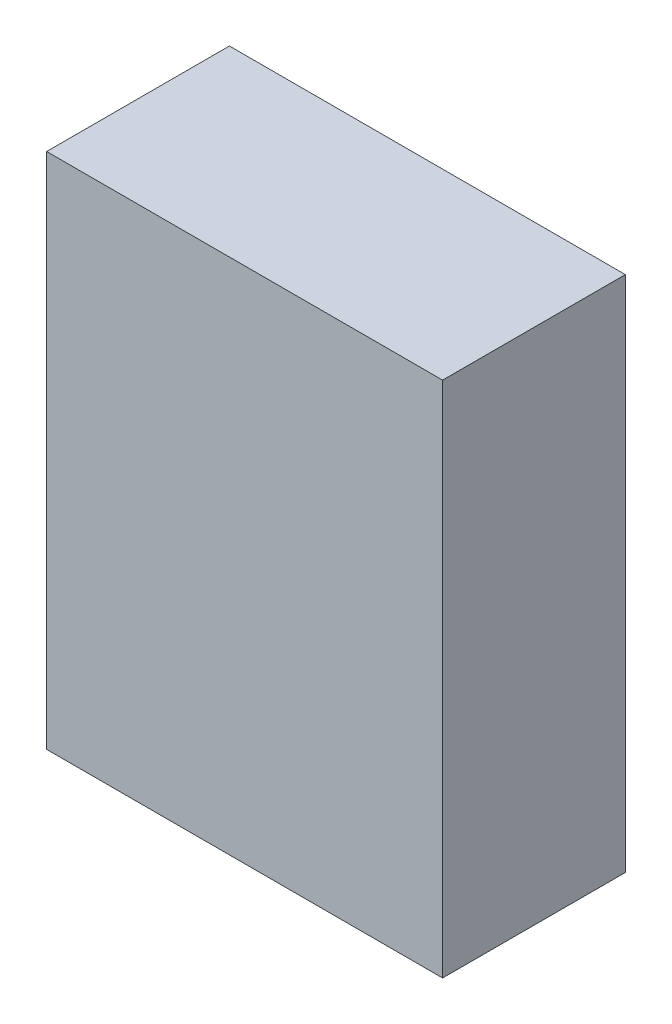
ISO-10303-21;
HEADER;
FILE_DESCRIPTION(('STEP AP214'),'2;1');
FILE_NAME('part.step','',(''),(''),'','','');
FILE_SCHEMA(('AUTOMOTIVE_DESIGN { 1 0 10303 214 1 1 1 1 }'));
ENDSEC;
DATA;
#1=APPLICATION_CONTEXT('core data for automotive mechanical design processes');
#2=APPLICATION_PROTOCOL_DEFINITION('international standard','automotive_design',2000,#1);
#3=PRODUCT_CONTEXT('',#1,'mechanical');
#4=PRODUCT('Part','Part','',(#3));
#5=PRODUCT_RELATED_PRODUCT_CATEGORY('part','',(#4));
#6=PRODUCT_DEFINITION_FORMATION('','',#4);
#7=PRODUCT_DEFINITION_CONTEXT('part definition',#1,'design');
#8=PRODUCT_DEFINITION('design','',#6,#7);
#9=PRODUCT_DEFINITION_SHAPE('','',#8);
#10=(LENGTH_UNIT() NAMED_UNIT(*) SI_UNIT(.MILLI.,.METRE.));
#11=(NAMED_UNIT(*) PLANE_ANGLE_UNIT() SI_UNIT($,.RADIAN.));
#12=(NAMED_UNIT(*) SI_UNIT($,.STERADIAN.) SOLID_ANGLE_UNIT());
#13=UNCERTAINTY_MEASURE_WITH_UNIT(LENGTH_MEASURE(1.E-05),#10,'distance_accuracy_value','');
#14=(GEOMETRIC_REPRESENTATION_CONTEXT(3) GLOBAL_UNCERTAINTY_ASSIGNED_CONTEXT((#13)) GLOBAL_UNIT_ASSIGNED_CONTEXT((#10,
#11,#12)) REPRESENTATION_CONTEXT('',''));
#15=CARTESIAN_POINT('',(0.,0.,0.));
#16=DIRECTION('',(0.,0.,1.));
#17=DIRECTION('',(1.,0.,0.));
#18=AXIS2_PLACEMENT_3D('',#15,#16,#17);
#19=CARTESIAN_POINT('',(-0.6499987,0.85000084,0.5999988));
#20=DIRECTION('',(0.,0.,-1.));
#21=DIRECTION('',(-1.,0.,0.));
#22=AXIS2_PLACEMENT_3D('',#19,#20,#21);
#23=PLANE('',#22);
#24=DIRECTION('',(1.,0.,0.));
#25=VECTOR('',#24,1.);
#26=CARTESIAN_POINT('',(-0.6499987,-0.8499983,0.5999988));
#27=LINE('',#26,#25);
#28=CARTESIAN_POINT('',(-0.6499987,-0.8499983,0.5999988));
#29=VERTEX_POINT('',#28);
#30=CARTESIAN_POINT('',(0.65000124,-0.8499983,0.5999988));
#31=VERTEX_POINT('',#30);
#32=EDGE_CURVE('E55',#29,#31,#27,.T.);
#33=ORIENTED_EDGE('',*,*,#32,.T.);
#34=DIRECTION('',(0.,1.,0.));
#35=VECTOR('',#34,1.);
#36=CARTESIAN_POINT('',(0.65000124,-0.8499983,0.5999988));
#37=LINE('',#36,#35);
#38=CARTESIAN_POINT('',(0.65000124,0.85000084,0.5999988));
#39=VERTEX_POINT('',#38);
#40=EDGE_CURVE('E57',#31,#39,#37,.T.);
#41=ORIENTED_EDGE('',*,*,#40,.T.);
#42=DIRECTION('',(1.,0.,0.));
#43=VECTOR('',#42,1.);
#44=CARTESIAN_POINT('',(0.65000124,0.85000084,0.5999988));
#45=LINE('',#44,#43);
#46=CARTESIAN_POINT('',(-0.6499987,0.85000084,0.5999988));
#47=VERTEX_POINT('',#46);
#48=EDGE_CURVE('E20',#39,#47,#45,.F.);
#49=ORIENTED_EDGE('',*,*,#48,.T.);
#50=DIRECTION('',(0.,1.,0.));
#51=VECTOR('',#50,1.);
#52=CARTESIAN_POINT('',(-0.6499987,0.85000084,0.5999988));
#53=LINE('',#52,#51);
#54=EDGE_CURVE('E80',#47,#29,#53,.F.);
#55=ORIENTED_EDGE('',*,*,#54,.T.);
#56=EDGE_LOOP('',(#33,#41,#49,#55));
#57=FACE_BOUND('',#56,.T.);
#58=ADVANCED_FACE('F17',(#57),#23,.F.);
#59=CARTESIAN_POINT('',(0.65000124,0.85000084,0.));
#60=DIRECTION('',(0.,-1.,0.));
#61=DIRECTION('',(0.,0.,-1.));
#62=AXIS2_PLACEMENT_3D('',#59,#60,#61);
#63=PLANE('',#62);
#64=DIRECTION('',(0.,0.,-1.));
#65=VECTOR('',#64,1.);
#66=CARTESIAN_POINT('',(-0.6499987,0.85000084,0.));
#67=LINE('',#66,#65);
#68=CARTESIAN_POINT('',(-0.6499987,0.85000084,0.));
#69=VERTEX_POINT('',#68);
#70=EDGE_CURVE('E68',#69,#47,#67,.F.);
#71=ORIENTED_EDGE('',*,*,#70,.T.);
#72=ORIENTED_EDGE('',*,*,#48,.F.);
#73=DIRECTION('',(0.,0.,1.));
#74=VECTOR('',#73,1.);
#75=CARTESIAN_POINT('',(0.65000124,0.85000084,0.));
#76=LINE('',#75,#74);
#77=CARTESIAN_POINT('',(0.65000124,0.85000084,0.));
#78=VERTEX_POINT('',#77);
#79=EDGE_CURVE('E63',#39,#78,#76,.F.);
#80=ORIENTED_EDGE('',*,*,#79,.T.);
#81=DIRECTION('',(-1.,0.,0.));
#82=VECTOR('',#81,1.);
#83=CARTESIAN_POINT('',(-0.6499987,0.85000084,0.));
#84=LINE('',#83,#82);
#85=EDGE_CURVE('E83',#69,#78,#84,.F.);
#86=ORIENTED_EDGE('',*,*,#85,.F.);
#87=EDGE_LOOP('',(#71,#72,#80,#86));
#88=FACE_BOUND('',#87,.T.);
#89=ADVANCED_FACE('F65',(#88),#63,.F.);
#90=CARTESIAN_POINT('',(0.65000124,-0.8499983,0.));
#91=DIRECTION('',(-1.,0.,0.));
#92=DIRECTION('',(0.,0.,1.));
#93=AXIS2_PLACEMENT_3D('',#90,#91,#92);
#94=PLANE('',#93);
#95=ORIENTED_EDGE('',*,*,#79,.F.);
#96=ORIENTED_EDGE('',*,*,#40,.F.);
#97=DIRECTION('',(0.,0.,1.));
#98=VECTOR('',#97,1.);
#99=CARTESIAN_POINT('',(0.65000124,-0.8499983,0.));
#100=LINE('',#99,#98);
#101=CARTESIAN_POINT('',(0.65000124,-0.8499983,0.));
#102=VERTEX_POINT('',#101);
#103=EDGE_CURVE('E75',#31,#102,#100,.F.);
#104=ORIENTED_EDGE('',*,*,#103,.T.);
#105=DIRECTION('',(0.,1.,0.));
#106=VECTOR('',#105,1.);
#107=CARTESIAN_POINT('',(0.65000124,0.85000084,0.));
#108=LINE('',#107,#106);
#109=EDGE_CURVE('E72',#78,#102,#108,.F.);
#110=ORIENTED_EDGE('',*,*,#109,.F.);
#111=EDGE_LOOP('',(#95,#96,#104,#110));
#112=FACE_BOUND('',#111,.T.);
#113=ADVANCED_FACE('F70',(#112),#94,.F.);
#114=CARTESIAN_POINT('',(-0.6499987,-0.8499983,0.));
#115=DIRECTION('',(0.,1.,0.));
#116=DIRECTION('',(0.,0.,1.));
#117=AXIS2_PLACEMENT_3D('',#114,#115,#116);
#118=PLANE('',#117);
#119=ORIENTED_EDGE('',*,*,#103,.F.);
#120=ORIENTED_EDGE('',*,*,#32,.F.);
#121=DIRECTION('',(0.,0.,-1.));
#122=VECTOR('',#121,1.);
#123=CARTESIAN_POINT('',(-0.6499987,-0.8499983,0.));
#124=LINE('',#123,#122);
#125=CARTESIAN_POINT('',(-0.6499987,-0.8499983,0.));
#126=VERTEX_POINT('',#125);
#127=EDGE_CURVE('E35',#29,#126,#124,.T.);
#128=ORIENTED_EDGE('',*,*,#127,.T.);
#129=DIRECTION('',(-1.,0.,0.));
#130=VECTOR('',#129,1.);
#131=CARTESIAN_POINT('',(-0.6499987,-0.8499983,0.));
#132=LINE('',#131,#130);
#133=EDGE_CURVE('E26',#102,#126,#132,.T.);
#134=ORIENTED_EDGE('',*,*,#133,.F.);
#135=EDGE_LOOP('',(#119,#120,#128,#134));
#136=FACE_BOUND('',#135,.T.);
#137=ADVANCED_FACE('F89',(#136),#118,.F.);
#138=CARTESIAN_POINT('',(-0.6499987,0.85000084,0.));
#139=DIRECTION('',(1.,0.,0.));
#140=DIRECTION('',(0.,0.,-1.));
#141=AXIS2_PLACEMENT_3D('',#138,#139,#140);
#142=PLANE('',#141);
#143=ORIENTED_EDGE('',*,*,#127,.F.);
#144=ORIENTED_EDGE('',*,*,#54,.F.);
#145=ORIENTED_EDGE('',*,*,#70,.F.);
#146=DIRECTION('',(0.,1.,0.));
#147=VECTOR('',#146,1.);
#148=CARTESIAN_POINT('',(-0.6499987,0.85000084,0.));
#149=LINE('',#148,#147);
#150=EDGE_CURVE('E11',#126,#69,#149,.T.);
#151=ORIENTED_EDGE('',*,*,#150,.F.);
#152=EDGE_LOOP('',(#143,#144,#145,#151));
#153=FACE_BOUND('',#152,.T.);
#154=ADVANCED_FACE('F91',(#153),#142,.F.);
#155=CARTESIAN_POINT('',(-0.6499987,0.85000084,0.));
#156=DIRECTION('',(0.,0.,-1.));
#157=DIRECTION('',(-1.,0.,0.));
#158=AXIS2_PLACEMENT_3D('',#155,#156,#157);
#159=PLANE('',#158);
#160=ORIENTED_EDGE('',*,*,#133,.T.);
#161=ORIENTED_EDGE('',*,*,#150,.T.);
#162=ORIENTED_EDGE('',*,*,#85,.T.);
#163=ORIENTED_EDGE('',*,*,#109,.T.);
#164=EDGE_LOOP('',(#160,#161,#162,#163));
#165=FACE_BOUND('',#164,.T.);
#166=ADVANCED_FACE('F88',(#165),#159,.T.);
#167=CLOSED_SHELL('',(#58,#89,#113,#137,#154,#166));
#168=MANIFOLD_SOLID_BREP('B1',#167);
#169=ADVANCED_BREP_SHAPE_REPRESENTATION('',(#18,#168),#14);
#170=SHAPE_DEFINITION_REPRESENTATION(#9,#169);
ENDSEC;
END-ISO-10303-21;
